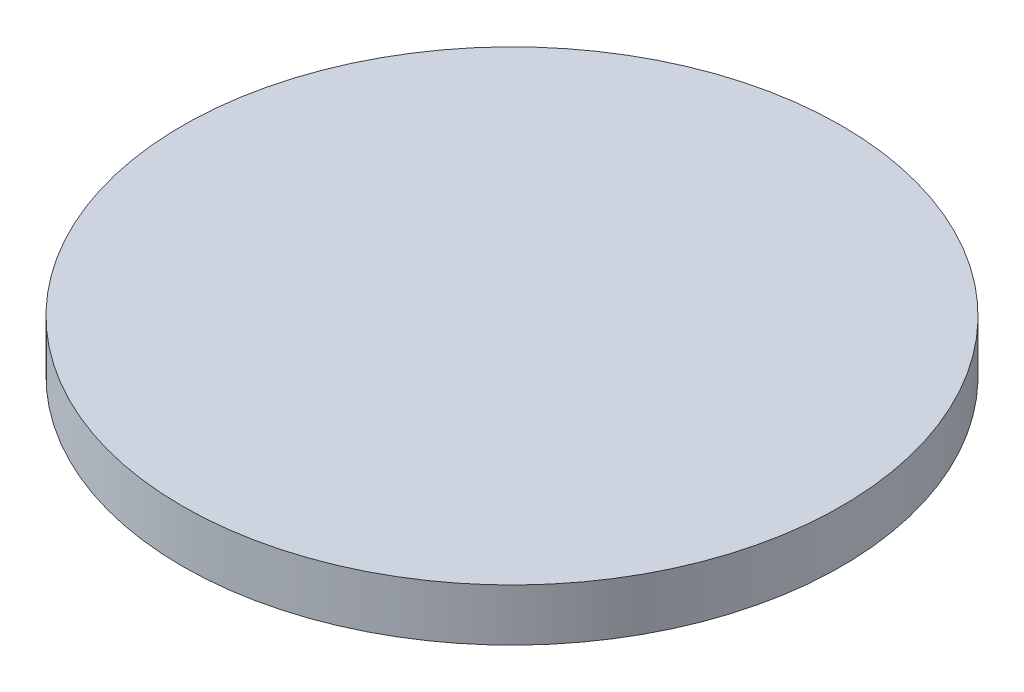
ISO-10303-21;
HEADER;
FILE_DESCRIPTION(('STEP AP214'),'2;1');
FILE_NAME('part.step','',(''),(''),'','','');
FILE_SCHEMA(('AUTOMOTIVE_DESIGN { 1 0 10303 214 1 1 1 1 }'));
ENDSEC;
DATA;
#1=APPLICATION_CONTEXT('core data for automotive mechanical design processes');
#2=APPLICATION_PROTOCOL_DEFINITION('international standard','automotive_design',2000,#1);
#3=PRODUCT_CONTEXT('',#1,'mechanical');
#4=PRODUCT('Part','Part','',(#3));
#5=PRODUCT_RELATED_PRODUCT_CATEGORY('part','',(#4));
#6=PRODUCT_DEFINITION_FORMATION('','',#4);
#7=PRODUCT_DEFINITION_CONTEXT('part definition',#1,'design');
#8=PRODUCT_DEFINITION('design','',#6,#7);
#9=PRODUCT_DEFINITION_SHAPE('','',#8);
#10=(LENGTH_UNIT() NAMED_UNIT(*) SI_UNIT(.MILLI.,.METRE.));
#11=(NAMED_UNIT(*) PLANE_ANGLE_UNIT() SI_UNIT($,.RADIAN.));
#12=(NAMED_UNIT(*) SI_UNIT($,.STERADIAN.) SOLID_ANGLE_UNIT());
#13=UNCERTAINTY_MEASURE_WITH_UNIT(LENGTH_MEASURE(1.E-05),#10,'distance_accuracy_value','');
#14=(GEOMETRIC_REPRESENTATION_CONTEXT(3) GLOBAL_UNCERTAINTY_ASSIGNED_CONTEXT((#13)) GLOBAL_UNIT_ASSIGNED_CONTEXT((#10,
#11,#12)) REPRESENTATION_CONTEXT('',''));
#15=CARTESIAN_POINT('',(0.,0.,0.));
#16=DIRECTION('',(0.,0.,1.));
#17=DIRECTION('',(1.,0.,0.));
#18=AXIS2_PLACEMENT_3D('',#15,#16,#17);
#19=CARTESIAN_POINT('',(0.,2.2,0.));
#20=DIRECTION('',(0.,-1.,0.));
#21=DIRECTION('',(0.,0.,-1.));
#22=AXIS2_PLACEMENT_3D('',#19,#20,#21);
#23=CYLINDRICAL_SURFACE('',#22,13.915);
#24=CARTESIAN_POINT('',(0.,2.2,0.));
#25=DIRECTION('',(0.,1.,0.));
#26=DIRECTION('',(0.,0.,1.));
#27=AXIS2_PLACEMENT_3D('',#24,#25,#26);
#28=CIRCLE('',#27,13.915);
#29=CARTESIAN_POINT('',(0.,2.2,13.915));
#30=VERTEX_POINT('',#29);
#31=EDGE_CURVE('E10',#30,#30,#28,.T.);
#32=ORIENTED_EDGE('',*,*,#31,.F.);
#33=EDGE_LOOP('',(#32));
#34=FACE_BOUND('',#33,.T.);
#35=CARTESIAN_POINT('',(0.,0.,0.));
#36=DIRECTION('',(0.,1.,0.));
#37=DIRECTION('',(0.,0.,1.));
#38=AXIS2_PLACEMENT_3D('',#35,#36,#37);
#39=CIRCLE('',#38,13.915);
#40=CARTESIAN_POINT('',(0.,0.,13.915));
#41=VERTEX_POINT('',#40);
#42=EDGE_CURVE('E42',#41,#41,#39,.T.);
#43=ORIENTED_EDGE('',*,*,#42,.T.);
#44=EDGE_LOOP('',(#43));
#45=FACE_BOUND('',#44,.T.);
#46=ADVANCED_FACE('F39',(#34,#45),#23,.T.);
#47=CARTESIAN_POINT('',(0.,2.2,0.));
#48=DIRECTION('',(0.,1.,0.));
#49=DIRECTION('',(0.,0.,1.));
#50=AXIS2_PLACEMENT_3D('',#47,#48,#49);
#51=PLANE('',#50);
#52=ORIENTED_EDGE('',*,*,#31,.T.);
#53=EDGE_LOOP('',(#52));
#54=FACE_BOUND('',#53,.T.);
#55=ADVANCED_FACE('F56',(#54),#51,.T.);
#56=CARTESIAN_POINT('',(0.,0.,0.));
#57=DIRECTION('',(0.,1.,0.));
#58=DIRECTION('',(0.,0.,1.));
#59=AXIS2_PLACEMENT_3D('',#56,#57,#58);
#60=PLANE('',#59);
#61=ORIENTED_EDGE('',*,*,#42,.F.);
#62=EDGE_LOOP('',(#61));
#63=FACE_BOUND('',#62,.T.);
#64=ADVANCED_FACE('F54',(#63),#60,.F.);
#65=CLOSED_SHELL('',(#46,#55,#64));
#66=MANIFOLD_SOLID_BREP('B2',#65);
#67=ADVANCED_BREP_SHAPE_REPRESENTATION('',(#18,#66),#14);
#68=SHAPE_DEFINITION_REPRESENTATION(#9,#67);
ENDSEC;
END-ISO-10303-21;
